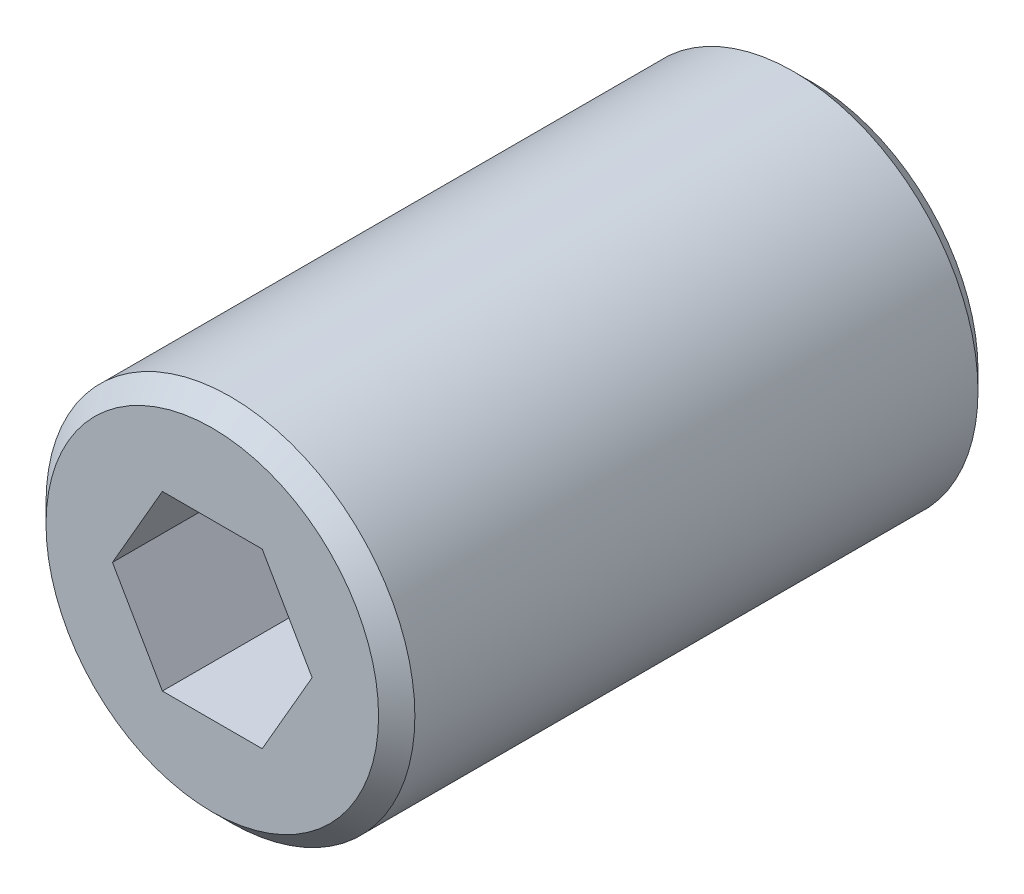
ISO-10303-21;
HEADER;
FILE_DESCRIPTION(('STEP AP214'),'2;1');
FILE_NAME('part.step','',(''),(''),'','','');
FILE_SCHEMA(('AUTOMOTIVE_DESIGN { 1 0 10303 214 1 1 1 1 }'));
ENDSEC;
DATA;
#1=APPLICATION_CONTEXT('core data for automotive mechanical design processes');
#2=APPLICATION_PROTOCOL_DEFINITION('international standard','automotive_design',2000,#1);
#3=PRODUCT_CONTEXT('',#1,'mechanical');
#4=PRODUCT('Part','Part','',(#3));
#5=PRODUCT_RELATED_PRODUCT_CATEGORY('part','',(#4));
#6=PRODUCT_DEFINITION_FORMATION('','',#4);
#7=PRODUCT_DEFINITION_CONTEXT('part definition',#1,'design');
#8=PRODUCT_DEFINITION('design','',#6,#7);
#9=PRODUCT_DEFINITION_SHAPE('','',#8);
#10=(LENGTH_UNIT() NAMED_UNIT(*) SI_UNIT(.MILLI.,.METRE.));
#11=(NAMED_UNIT(*) PLANE_ANGLE_UNIT() SI_UNIT($,.RADIAN.));
#12=(NAMED_UNIT(*) SI_UNIT($,.STERADIAN.) SOLID_ANGLE_UNIT());
#13=UNCERTAINTY_MEASURE_WITH_UNIT(LENGTH_MEASURE(1.E-05),#10,'distance_accuracy_value','');
#14=(GEOMETRIC_REPRESENTATION_CONTEXT(3) GLOBAL_UNCERTAINTY_ASSIGNED_CONTEXT((#13)) GLOBAL_UNIT_ASSIGNED_CONTEXT((#10,
#11,#12)) REPRESENTATION_CONTEXT('',''));
#15=CARTESIAN_POINT('',(0.,0.,0.));
#16=DIRECTION('',(0.,0.,1.));
#17=DIRECTION('',(1.,0.,0.));
#18=AXIS2_PLACEMENT_3D('',#15,#16,#17);
#19=CARTESIAN_POINT('',(0.,0.,33.02));
#20=DIRECTION('',(0.,0.,1.));
#21=DIRECTION('',(1.,0.,0.));
#22=AXIS2_PLACEMENT_3D('',#19,#20,#21);
#23=PLANE('',#22);
#24=CARTESIAN_POINT('',(0.,0.,33.02));
#25=DIRECTION('',(0.,0.,1.));
#26=DIRECTION('',(1.,0.,0.));
#27=AXIS2_PLACEMENT_3D('',#24,#25,#26);
#28=CIRCLE('',#27,9.16);
#29=CARTESIAN_POINT('',(9.16,0.,33.02));
#30=VERTEX_POINT('',#29);
#31=EDGE_CURVE('E11',#30,#30,#28,.T.);
#32=ORIENTED_EDGE('',*,*,#31,.T.);
#33=EDGE_LOOP('',(#32));
#34=FACE_BOUND('',#33,.T.);
#35=DIRECTION('',(-0.5,0.866025403784439,0.));
#36=VECTOR('',#35,1.);
#37=CARTESIAN_POINT('',(5.49926131403118,0.,33.02));
#38=LINE('',#37,#36);
#39=CARTESIAN_POINT('',(5.49926131403118,0.,33.02));
#40=VERTEX_POINT('',#39);
#41=CARTESIAN_POINT('',(2.74963065701559,4.76250000000001,33.02));
#42=VERTEX_POINT('',#41);
#43=EDGE_CURVE('E104',#40,#42,#38,.T.);
#44=ORIENTED_EDGE('',*,*,#43,.F.);
#45=DIRECTION('',(0.5,0.866025403784439,0.));
#46=VECTOR('',#45,1.);
#47=CARTESIAN_POINT('',(2.74963065701559,-4.7625,33.02));
#48=LINE('',#47,#46);
#49=CARTESIAN_POINT('',(2.74963065701559,-4.7625,33.02));
#50=VERTEX_POINT('',#49);
#51=EDGE_CURVE('E95',#50,#40,#48,.T.);
#52=ORIENTED_EDGE('',*,*,#51,.F.);
#53=DIRECTION('',(1.,0.,0.));
#54=VECTOR('',#53,1.);
#55=CARTESIAN_POINT('',(-2.74963065701559,-4.7625,33.02));
#56=LINE('',#55,#54);
#57=CARTESIAN_POINT('',(-2.74963065701559,-4.7625,33.02));
#58=VERTEX_POINT('',#57);
#59=EDGE_CURVE('E130',#58,#50,#56,.T.);
#60=ORIENTED_EDGE('',*,*,#59,.F.);
#61=DIRECTION('',(0.5,-0.866025403784439,0.));
#62=VECTOR('',#61,1.);
#63=CARTESIAN_POINT('',(-5.49926131403119,0.,33.02));
#64=LINE('',#63,#62);
#65=CARTESIAN_POINT('',(-5.49926131403119,0.,33.02));
#66=VERTEX_POINT('',#65);
#67=EDGE_CURVE('E127',#66,#58,#64,.T.);
#68=ORIENTED_EDGE('',*,*,#67,.F.);
#69=DIRECTION('',(-0.5,-0.866025403784439,0.));
#70=VECTOR('',#69,1.);
#71=CARTESIAN_POINT('',(-2.74963065701559,4.76250000000001,33.02));
#72=LINE('',#71,#70);
#73=CARTESIAN_POINT('',(-2.74963065701559,4.76250000000001,33.02));
#74=VERTEX_POINT('',#73);
#75=EDGE_CURVE('E122',#74,#66,#72,.T.);
#76=ORIENTED_EDGE('',*,*,#75,.F.);
#77=DIRECTION('',(-1.,0.,0.));
#78=VECTOR('',#77,1.);
#79=CARTESIAN_POINT('',(2.74963065701559,4.76250000000001,33.02));
#80=LINE('',#79,#78);
#81=EDGE_CURVE('E118',#42,#74,#80,.T.);
#82=ORIENTED_EDGE('',*,*,#81,.F.);
#83=EDGE_LOOP('',(#44,#52,#60,#68,#76,#82));
#84=FACE_BOUND('',#83,.T.);
#85=ADVANCED_FACE('F41',(#34,#84),#23,.T.);
#86=CARTESIAN_POINT('',(0.,0.,0.));
#87=DIRECTION('',(0.,0.,1.));
#88=DIRECTION('',(1.,0.,0.));
#89=AXIS2_PLACEMENT_3D('',#86,#87,#88);
#90=PLANE('',#89);
#91=CARTESIAN_POINT('',(0.,0.,0.));
#92=DIRECTION('',(0.,0.,1.));
#93=DIRECTION('',(1.,0.,0.));
#94=AXIS2_PLACEMENT_3D('',#91,#92,#93);
#95=CIRCLE('',#94,9.15999999999999);
#96=CARTESIAN_POINT('',(9.15999999999999,0.,0.));
#97=VERTEX_POINT('',#96);
#98=EDGE_CURVE('E50',#97,#97,#95,.F.);
#99=ORIENTED_EDGE('',*,*,#98,.T.);
#100=EDGE_LOOP('',(#99));
#101=FACE_BOUND('',#100,.T.);
#102=DIRECTION('',(0.5,0.866025403784439,0.));
#103=VECTOR('',#102,1.);
#104=CARTESIAN_POINT('',(2.74963065701559,-4.7625,0.));
#105=LINE('',#104,#103);
#106=CARTESIAN_POINT('',(2.74963065701559,-4.7625,0.));
#107=VERTEX_POINT('',#106);
#108=CARTESIAN_POINT('',(5.49926131403118,0.,0.));
#109=VERTEX_POINT('',#108);
#110=EDGE_CURVE('E65',#107,#109,#105,.T.);
#111=ORIENTED_EDGE('',*,*,#110,.T.);
#112=DIRECTION('',(-0.5,0.866025403784439,0.));
#113=VECTOR('',#112,1.);
#114=CARTESIAN_POINT('',(5.49926131403118,0.,0.));
#115=LINE('',#114,#113);
#116=CARTESIAN_POINT('',(2.74963065701559,4.76250000000001,0.));
#117=VERTEX_POINT('',#116);
#118=EDGE_CURVE('E111',#109,#117,#115,.T.);
#119=ORIENTED_EDGE('',*,*,#118,.T.);
#120=DIRECTION('',(-1.,0.,0.));
#121=VECTOR('',#120,1.);
#122=CARTESIAN_POINT('',(2.74963065701559,4.76250000000001,0.));
#123=LINE('',#122,#121);
#124=CARTESIAN_POINT('',(-2.74963065701559,4.76250000000001,0.));
#125=VERTEX_POINT('',#124);
#126=EDGE_CURVE('E137',#117,#125,#123,.T.);
#127=ORIENTED_EDGE('',*,*,#126,.T.);
#128=DIRECTION('',(-0.5,-0.866025403784439,0.));
#129=VECTOR('',#128,1.);
#130=CARTESIAN_POINT('',(-2.74963065701559,4.76250000000001,0.));
#131=LINE('',#130,#129);
#132=CARTESIAN_POINT('',(-5.49926131403119,0.,0.));
#133=VERTEX_POINT('',#132);
#134=EDGE_CURVE('E141',#125,#133,#131,.T.);
#135=ORIENTED_EDGE('',*,*,#134,.T.);
#136=DIRECTION('',(0.5,-0.866025403784439,0.));
#137=VECTOR('',#136,1.);
#138=CARTESIAN_POINT('',(-5.49926131403119,0.,0.));
#139=LINE('',#138,#137);
#140=CARTESIAN_POINT('',(-2.74963065701559,-4.7625,0.));
#141=VERTEX_POINT('',#140);
#142=EDGE_CURVE('E145',#133,#141,#139,.T.);
#143=ORIENTED_EDGE('',*,*,#142,.T.);
#144=DIRECTION('',(1.,0.,0.));
#145=VECTOR('',#144,1.);
#146=CARTESIAN_POINT('',(-2.74963065701559,-4.7625,0.));
#147=LINE('',#146,#145);
#148=EDGE_CURVE('E105',#141,#107,#147,.T.);
#149=ORIENTED_EDGE('',*,*,#148,.T.);
#150=EDGE_LOOP('',(#111,#119,#127,#135,#143,#149));
#151=FACE_BOUND('',#150,.T.);
#152=ADVANCED_FACE('F174',(#101,#151),#90,.F.);
#153=CARTESIAN_POINT('',(0.,0.,33.02));
#154=DIRECTION('',(0.,0.,-1.));
#155=DIRECTION('',(-1.,0.,0.));
#156=AXIS2_PLACEMENT_3D('',#153,#154,#155);
#157=CYLINDRICAL_SURFACE('',#156,10.16);
#158=CARTESIAN_POINT('',(0.,0.,1.00000000000001));
#159=DIRECTION('',(0.,0.,1.));
#160=DIRECTION('',(1.,0.,0.));
#161=AXIS2_PLACEMENT_3D('',#158,#159,#160);
#162=CIRCLE('',#161,10.16);
#163=CARTESIAN_POINT('',(10.16,0.,1.00000000000001));
#164=VERTEX_POINT('',#163);
#165=EDGE_CURVE('E167',#164,#164,#162,.T.);
#166=ORIENTED_EDGE('',*,*,#165,.T.);
#167=EDGE_LOOP('',(#166));
#168=FACE_BOUND('',#167,.T.);
#169=CARTESIAN_POINT('',(0.,0.,32.02));
#170=DIRECTION('',(0.,0.,1.));
#171=DIRECTION('',(1.,0.,0.));
#172=AXIS2_PLACEMENT_3D('',#169,#170,#171);
#173=CIRCLE('',#172,10.16);
#174=CARTESIAN_POINT('',(10.16,0.,32.02));
#175=VERTEX_POINT('',#174);
#176=EDGE_CURVE('E113',#175,#175,#173,.F.);
#177=ORIENTED_EDGE('',*,*,#176,.T.);
#178=EDGE_LOOP('',(#177));
#179=FACE_BOUND('',#178,.T.);
#180=ADVANCED_FACE('F183',(#168,#179),#157,.T.);
#181=CARTESIAN_POINT('',(2.74963065701559,-4.7625,33.02));
#182=DIRECTION('',(-0.866025403784439,0.5,0.));
#183=DIRECTION('',(-0.5,-0.866025403784439,0.));
#184=AXIS2_PLACEMENT_3D('',#181,#182,#183);
#185=PLANE('',#184);
#186=ORIENTED_EDGE('',*,*,#110,.F.);
#187=DIRECTION('',(0.,0.,-1.));
#188=VECTOR('',#187,1.);
#189=CARTESIAN_POINT('',(2.74963065701559,-4.7625,33.02));
#190=LINE('',#189,#188);
#191=EDGE_CURVE('E99',#50,#107,#190,.T.);
#192=ORIENTED_EDGE('',*,*,#191,.F.);
#193=ORIENTED_EDGE('',*,*,#51,.T.);
#194=DIRECTION('',(0.,0.,-1.));
#195=VECTOR('',#194,1.);
#196=CARTESIAN_POINT('',(5.49926131403118,0.,33.02));
#197=LINE('',#196,#195);
#198=EDGE_CURVE('E98',#40,#109,#197,.T.);
#199=ORIENTED_EDGE('',*,*,#198,.T.);
#200=EDGE_LOOP('',(#186,#192,#193,#199));
#201=FACE_BOUND('',#200,.T.);
#202=ADVANCED_FACE('F97',(#201),#185,.T.);
#203=CARTESIAN_POINT('',(5.49926131403118,0.,33.02));
#204=DIRECTION('',(-0.866025403784439,-0.5,0.));
#205=DIRECTION('',(0.5,-0.866025403784439,0.));
#206=AXIS2_PLACEMENT_3D('',#203,#204,#205);
#207=PLANE('',#206);
#208=ORIENTED_EDGE('',*,*,#118,.F.);
#209=ORIENTED_EDGE('',*,*,#198,.F.);
#210=ORIENTED_EDGE('',*,*,#43,.T.);
#211=DIRECTION('',(0.,0.,-1.));
#212=VECTOR('',#211,1.);
#213=CARTESIAN_POINT('',(2.74963065701559,4.76250000000001,33.02));
#214=LINE('',#213,#212);
#215=EDGE_CURVE('E114',#42,#117,#214,.T.);
#216=ORIENTED_EDGE('',*,*,#215,.T.);
#217=EDGE_LOOP('',(#208,#209,#210,#216));
#218=FACE_BOUND('',#217,.T.);
#219=ADVANCED_FACE('F108',(#218),#207,.T.);
#220=CARTESIAN_POINT('',(2.74963065701559,4.76250000000001,33.02));
#221=DIRECTION('',(0.,-1.,0.));
#222=DIRECTION('',(0.,0.,-1.));
#223=AXIS2_PLACEMENT_3D('',#220,#221,#222);
#224=PLANE('',#223);
#225=ORIENTED_EDGE('',*,*,#126,.F.);
#226=ORIENTED_EDGE('',*,*,#215,.F.);
#227=ORIENTED_EDGE('',*,*,#81,.T.);
#228=DIRECTION('',(0.,0.,-1.));
#229=VECTOR('',#228,1.);
#230=CARTESIAN_POINT('',(-2.74963065701559,4.76250000000001,33.02));
#231=LINE('',#230,#229);
#232=EDGE_CURVE('E159',#74,#125,#231,.T.);
#233=ORIENTED_EDGE('',*,*,#232,.T.);
#234=EDGE_LOOP('',(#225,#226,#227,#233));
#235=FACE_BOUND('',#234,.T.);
#236=ADVANCED_FACE('F204',(#235),#224,.T.);
#237=CARTESIAN_POINT('',(-2.74963065701559,4.76250000000001,33.02));
#238=DIRECTION('',(0.866025403784439,-0.5,0.));
#239=DIRECTION('',(0.5,0.866025403784439,0.));
#240=AXIS2_PLACEMENT_3D('',#237,#238,#239);
#241=PLANE('',#240);
#242=ORIENTED_EDGE('',*,*,#134,.F.);
#243=ORIENTED_EDGE('',*,*,#232,.F.);
#244=ORIENTED_EDGE('',*,*,#75,.T.);
#245=DIRECTION('',(0.,0.,-1.));
#246=VECTOR('',#245,1.);
#247=CARTESIAN_POINT('',(-5.49926131403119,0.,33.02));
#248=LINE('',#247,#246);
#249=EDGE_CURVE('E156',#66,#133,#248,.T.);
#250=ORIENTED_EDGE('',*,*,#249,.T.);
#251=EDGE_LOOP('',(#242,#243,#244,#250));
#252=FACE_BOUND('',#251,.T.);
#253=ADVANCED_FACE('F207',(#252),#241,.T.);
#254=CARTESIAN_POINT('',(-5.49926131403119,0.,33.02));
#255=DIRECTION('',(0.866025403784439,0.5,0.));
#256=DIRECTION('',(-0.5,0.866025403784439,0.));
#257=AXIS2_PLACEMENT_3D('',#254,#255,#256);
#258=PLANE('',#257);
#259=ORIENTED_EDGE('',*,*,#142,.F.);
#260=ORIENTED_EDGE('',*,*,#249,.F.);
#261=ORIENTED_EDGE('',*,*,#67,.T.);
#262=DIRECTION('',(0.,0.,-1.));
#263=VECTOR('',#262,1.);
#264=CARTESIAN_POINT('',(-2.74963065701559,-4.7625,33.02));
#265=LINE('',#264,#263);
#266=EDGE_CURVE('E57',#58,#141,#265,.T.);
#267=ORIENTED_EDGE('',*,*,#266,.T.);
#268=EDGE_LOOP('',(#259,#260,#261,#267));
#269=FACE_BOUND('',#268,.T.);
#270=ADVANCED_FACE('F211',(#269),#258,.T.);
#271=CARTESIAN_POINT('',(-2.74963065701559,-4.7625,33.02));
#272=DIRECTION('',(0.,1.,0.));
#273=DIRECTION('',(-1.,0.,0.));
#274=AXIS2_PLACEMENT_3D('',#271,#272,#273);
#275=PLANE('',#274);
#276=ORIENTED_EDGE('',*,*,#148,.F.);
#277=ORIENTED_EDGE('',*,*,#266,.F.);
#278=ORIENTED_EDGE('',*,*,#59,.T.);
#279=ORIENTED_EDGE('',*,*,#191,.T.);
#280=EDGE_LOOP('',(#276,#277,#278,#279));
#281=FACE_BOUND('',#280,.T.);
#282=ADVANCED_FACE('F180',(#281),#275,.T.);
#283=CARTESIAN_POINT('',(0.,0.,1.00000000000001));
#284=DIRECTION('',(0.,0.,1.));
#285=DIRECTION('',(1.,0.,0.));
#286=AXIS2_PLACEMENT_3D('',#283,#284,#285);
#287=CONICAL_SURFACE('',#286,10.16,0.785398163397447);
#288=ORIENTED_EDGE('',*,*,#98,.F.);
#289=EDGE_LOOP('',(#288));
#290=FACE_BOUND('',#289,.T.);
#291=ORIENTED_EDGE('',*,*,#165,.F.);
#292=EDGE_LOOP('',(#291));
#293=FACE_BOUND('',#292,.T.);
#294=ADVANCED_FACE('F177',(#290,#293),#287,.T.);
#295=CARTESIAN_POINT('',(0.,0.,33.02));
#296=DIRECTION('',(0.,0.,-1.));
#297=DIRECTION('',(-1.,0.,0.));
#298=AXIS2_PLACEMENT_3D('',#295,#296,#297);
#299=CONICAL_SURFACE('',#298,9.16,0.785398163397444);
#300=ORIENTED_EDGE('',*,*,#176,.F.);
#301=EDGE_LOOP('',(#300));
#302=FACE_BOUND('',#301,.T.);
#303=ORIENTED_EDGE('',*,*,#31,.F.);
#304=EDGE_LOOP('',(#303));
#305=FACE_BOUND('',#304,.T.);
#306=ADVANCED_FACE('F43',(#302,#305),#299,.T.);
#307=CLOSED_SHELL('',(#85,#152,#180,#202,#219,#236,#253,#270,#282,#294,#306));
#308=MANIFOLD_SOLID_BREP('B2',#307);
#309=ADVANCED_BREP_SHAPE_REPRESENTATION('',(#18,#308),#14);
#310=SHAPE_DEFINITION_REPRESENTATION(#9,#309);
ENDSEC;
END-ISO-10303-21;
